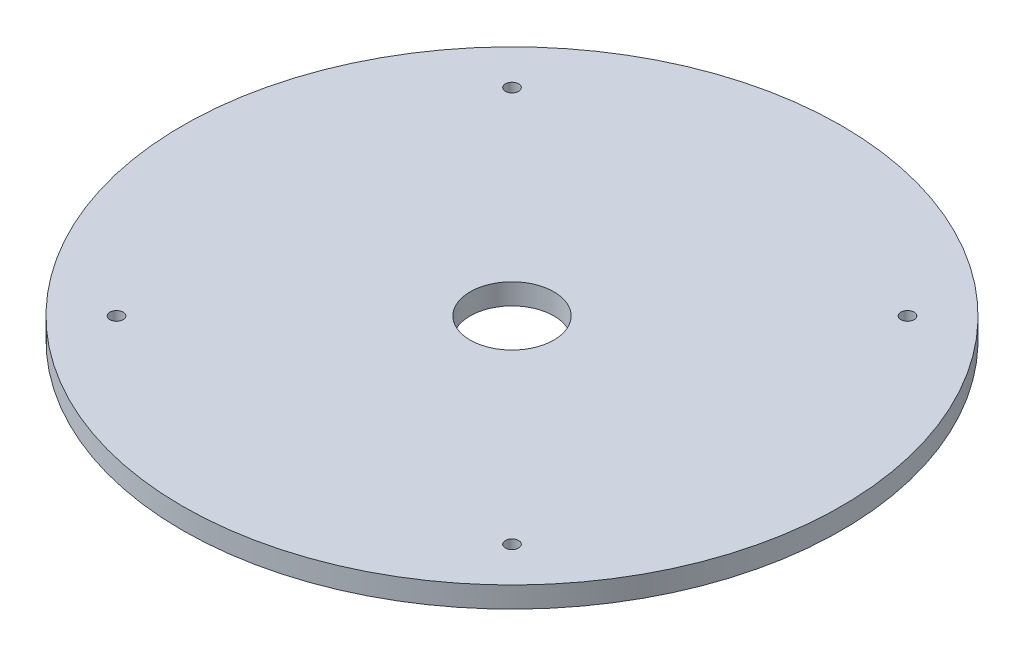
ISO-10303-21;
HEADER;
FILE_DESCRIPTION(('STEP AP214'),'2;1');
FILE_NAME('part.step','',(''),(''),'','','');
FILE_SCHEMA(('AUTOMOTIVE_DESIGN { 1 0 10303 214 1 1 1 1 }'));
ENDSEC;
DATA;
#1=APPLICATION_CONTEXT('core data for automotive mechanical design processes');
#2=APPLICATION_PROTOCOL_DEFINITION('international standard','automotive_design',2000,#1);
#3=PRODUCT_CONTEXT('',#1,'mechanical');
#4=PRODUCT('Part','Part','',(#3));
#5=PRODUCT_RELATED_PRODUCT_CATEGORY('part','',(#4));
#6=PRODUCT_DEFINITION_FORMATION('','',#4);
#7=PRODUCT_DEFINITION_CONTEXT('part definition',#1,'design');
#8=PRODUCT_DEFINITION('design','',#6,#7);
#9=PRODUCT_DEFINITION_SHAPE('','',#8);
#10=(LENGTH_UNIT() NAMED_UNIT(*) SI_UNIT(.MILLI.,.METRE.));
#11=(NAMED_UNIT(*) PLANE_ANGLE_UNIT() SI_UNIT($,.RADIAN.));
#12=(NAMED_UNIT(*) SI_UNIT($,.STERADIAN.) SOLID_ANGLE_UNIT());
#13=UNCERTAINTY_MEASURE_WITH_UNIT(LENGTH_MEASURE(1.E-05),#10,'distance_accuracy_value','');
#14=(GEOMETRIC_REPRESENTATION_CONTEXT(3) GLOBAL_UNCERTAINTY_ASSIGNED_CONTEXT((#13)) GLOBAL_UNIT_ASSIGNED_CONTEXT((#10,
#11,#12)) REPRESENTATION_CONTEXT('',''));
#15=CARTESIAN_POINT('',(0.,0.,0.));
#16=DIRECTION('',(0.,0.,1.));
#17=DIRECTION('',(1.,0.,0.));
#18=AXIS2_PLACEMENT_3D('',#15,#16,#17);
#19=CARTESIAN_POINT('',(0.,3.175,0.));
#20=DIRECTION('',(0.,1.,0.));
#21=DIRECTION('',(0.,0.,1.));
#22=AXIS2_PLACEMENT_3D('',#19,#20,#21);
#23=PLANE('',#22);
#24=CARTESIAN_POINT('',(-30.,3.175,30.));
#25=DIRECTION('',(0.,1.,0.));
#26=DIRECTION('',(0.,0.,1.));
#27=AXIS2_PLACEMENT_3D('',#24,#25,#26);
#28=CIRCLE('',#27,1.);
#29=CARTESIAN_POINT('',(-30.,3.175,31.));
#30=VERTEX_POINT('',#29);
#31=EDGE_CURVE('E65',#30,#30,#28,.T.);
#32=ORIENTED_EDGE('',*,*,#31,.F.);
#33=EDGE_LOOP('',(#32));
#34=FACE_BOUND('',#33,.T.);
#35=CARTESIAN_POINT('',(30.,3.175,-30.));
#36=DIRECTION('',(0.,1.,0.));
#37=DIRECTION('',(0.,0.,1.));
#38=AXIS2_PLACEMENT_3D('',#35,#36,#37);
#39=CIRCLE('',#38,1.);
#40=CARTESIAN_POINT('',(30.,3.175,-29.));
#41=VERTEX_POINT('',#40);
#42=EDGE_CURVE('E53',#41,#41,#39,.T.);
#43=ORIENTED_EDGE('',*,*,#42,.F.);
#44=EDGE_LOOP('',(#43));
#45=FACE_BOUND('',#44,.T.);
#46=CARTESIAN_POINT('',(0.,3.175,0.));
#47=DIRECTION('',(0.,1.,0.));
#48=DIRECTION('',(0.,0.,1.));
#49=AXIS2_PLACEMENT_3D('',#46,#47,#48);
#50=CIRCLE('',#49,50.);
#51=CARTESIAN_POINT('',(0.,3.175,50.));
#52=VERTEX_POINT('',#51);
#53=EDGE_CURVE('E10',#52,#52,#50,.T.);
#54=ORIENTED_EDGE('',*,*,#53,.T.);
#55=EDGE_LOOP('',(#54));
#56=FACE_BOUND('',#55,.T.);
#57=CARTESIAN_POINT('',(-30.,3.175,-30.));
#58=DIRECTION('',(0.,1.,0.));
#59=DIRECTION('',(0.,0.,1.));
#60=AXIS2_PLACEMENT_3D('',#57,#58,#59);
#61=CIRCLE('',#60,1.);
#62=CARTESIAN_POINT('',(-30.,3.175,-29.));
#63=VERTEX_POINT('',#62);
#64=EDGE_CURVE('E48',#63,#63,#61,.T.);
#65=ORIENTED_EDGE('',*,*,#64,.F.);
#66=EDGE_LOOP('',(#65));
#67=FACE_BOUND('',#66,.T.);
#68=CARTESIAN_POINT('',(30.,3.175,30.));
#69=DIRECTION('',(0.,1.,0.));
#70=DIRECTION('',(0.,0.,1.));
#71=AXIS2_PLACEMENT_3D('',#68,#69,#70);
#72=CIRCLE('',#71,1.);
#73=CARTESIAN_POINT('',(30.,3.175,31.));
#74=VERTEX_POINT('',#73);
#75=EDGE_CURVE('E59',#74,#74,#72,.T.);
#76=ORIENTED_EDGE('',*,*,#75,.F.);
#77=EDGE_LOOP('',(#76));
#78=FACE_BOUND('',#77,.T.);
#79=CARTESIAN_POINT('',(0.,3.175,0.));
#80=DIRECTION('',(0.,1.,0.));
#81=DIRECTION('',(0.,0.,1.));
#82=AXIS2_PLACEMENT_3D('',#79,#80,#81);
#83=CIRCLE('',#82,6.35);
#84=CARTESIAN_POINT('',(0.,3.175,6.35));
#85=VERTEX_POINT('',#84);
#86=EDGE_CURVE('E71',#85,#85,#83,.T.);
#87=ORIENTED_EDGE('',*,*,#86,.F.);
#88=EDGE_LOOP('',(#87));
#89=FACE_BOUND('',#88,.T.);
#90=ADVANCED_FACE('F37',(#34,#45,#56,#67,#78,#89),#23,.T.);
#91=CARTESIAN_POINT('',(0.,0.,0.));
#92=DIRECTION('',(0.,1.,0.));
#93=DIRECTION('',(0.,0.,1.));
#94=AXIS2_PLACEMENT_3D('',#91,#92,#93);
#95=PLANE('',#94);
#96=CARTESIAN_POINT('',(0.,0.,0.));
#97=DIRECTION('',(0.,1.,0.));
#98=DIRECTION('',(0.,0.,1.));
#99=AXIS2_PLACEMENT_3D('',#96,#97,#98);
#100=CIRCLE('',#99,50.);
#101=CARTESIAN_POINT('',(0.,0.,50.));
#102=VERTEX_POINT('',#101);
#103=EDGE_CURVE('E41',#102,#102,#100,.T.);
#104=ORIENTED_EDGE('',*,*,#103,.F.);
#105=EDGE_LOOP('',(#104));
#106=FACE_BOUND('',#105,.T.);
#107=CARTESIAN_POINT('',(-30.,0.,-30.));
#108=DIRECTION('',(0.,1.,0.));
#109=DIRECTION('',(0.,0.,1.));
#110=AXIS2_PLACEMENT_3D('',#107,#108,#109);
#111=CIRCLE('',#110,1.);
#112=CARTESIAN_POINT('',(-30.,0.,-29.));
#113=VERTEX_POINT('',#112);
#114=EDGE_CURVE('E50',#113,#113,#111,.T.);
#115=ORIENTED_EDGE('',*,*,#114,.T.);
#116=EDGE_LOOP('',(#115));
#117=FACE_BOUND('',#116,.T.);
#118=CARTESIAN_POINT('',(30.,0.,-30.));
#119=DIRECTION('',(0.,1.,0.));
#120=DIRECTION('',(0.,0.,1.));
#121=AXIS2_PLACEMENT_3D('',#118,#119,#120);
#122=CIRCLE('',#121,1.);
#123=CARTESIAN_POINT('',(30.,0.,-29.));
#124=VERTEX_POINT('',#123);
#125=EDGE_CURVE('E56',#124,#124,#122,.T.);
#126=ORIENTED_EDGE('',*,*,#125,.T.);
#127=EDGE_LOOP('',(#126));
#128=FACE_BOUND('',#127,.T.);
#129=CARTESIAN_POINT('',(30.,0.,30.));
#130=DIRECTION('',(0.,1.,0.));
#131=DIRECTION('',(0.,0.,1.));
#132=AXIS2_PLACEMENT_3D('',#129,#130,#131);
#133=CIRCLE('',#132,1.);
#134=CARTESIAN_POINT('',(30.,0.,31.));
#135=VERTEX_POINT('',#134);
#136=EDGE_CURVE('E62',#135,#135,#133,.T.);
#137=ORIENTED_EDGE('',*,*,#136,.T.);
#138=EDGE_LOOP('',(#137));
#139=FACE_BOUND('',#138,.T.);
#140=CARTESIAN_POINT('',(-30.,0.,30.));
#141=DIRECTION('',(0.,1.,0.));
#142=DIRECTION('',(0.,0.,1.));
#143=AXIS2_PLACEMENT_3D('',#140,#141,#142);
#144=CIRCLE('',#143,1.);
#145=CARTESIAN_POINT('',(-30.,0.,31.));
#146=VERTEX_POINT('',#145);
#147=EDGE_CURVE('E68',#146,#146,#144,.T.);
#148=ORIENTED_EDGE('',*,*,#147,.T.);
#149=EDGE_LOOP('',(#148));
#150=FACE_BOUND('',#149,.T.);
#151=CARTESIAN_POINT('',(0.,0.,0.));
#152=DIRECTION('',(0.,1.,0.));
#153=DIRECTION('',(0.,0.,1.));
#154=AXIS2_PLACEMENT_3D('',#151,#152,#153);
#155=CIRCLE('',#154,6.35);
#156=CARTESIAN_POINT('',(0.,0.,6.35));
#157=VERTEX_POINT('',#156);
#158=EDGE_CURVE('E74',#157,#157,#155,.T.);
#159=ORIENTED_EDGE('',*,*,#158,.T.);
#160=EDGE_LOOP('',(#159));
#161=FACE_BOUND('',#160,.T.);
#162=ADVANCED_FACE('F84',(#106,#117,#128,#139,#150,#161),#95,.F.);
#163=CARTESIAN_POINT('',(0.,3.175,0.));
#164=DIRECTION('',(0.,-1.,0.));
#165=DIRECTION('',(0.,0.,-1.));
#166=AXIS2_PLACEMENT_3D('',#163,#164,#165);
#167=CYLINDRICAL_SURFACE('',#166,50.);
#168=ORIENTED_EDGE('',*,*,#53,.F.);
#169=EDGE_LOOP('',(#168));
#170=FACE_BOUND('',#169,.T.);
#171=ORIENTED_EDGE('',*,*,#103,.T.);
#172=EDGE_LOOP('',(#171));
#173=FACE_BOUND('',#172,.T.);
#174=ADVANCED_FACE('F39',(#170,#173),#167,.T.);
#175=CARTESIAN_POINT('',(-30.,3.175,-30.));
#176=DIRECTION('',(0.,-1.,0.));
#177=DIRECTION('',(0.,0.,-1.));
#178=AXIS2_PLACEMENT_3D('',#175,#176,#177);
#179=CYLINDRICAL_SURFACE('',#178,1.);
#180=ORIENTED_EDGE('',*,*,#64,.T.);
#181=EDGE_LOOP('',(#180));
#182=FACE_BOUND('',#181,.T.);
#183=ORIENTED_EDGE('',*,*,#114,.F.);
#184=EDGE_LOOP('',(#183));
#185=FACE_BOUND('',#184,.T.);
#186=ADVANCED_FACE('F94',(#182,#185),#179,.F.);
#187=CARTESIAN_POINT('',(30.,3.175,-30.));
#188=DIRECTION('',(0.,-1.,0.));
#189=DIRECTION('',(0.,0.,-1.));
#190=AXIS2_PLACEMENT_3D('',#187,#188,#189);
#191=CYLINDRICAL_SURFACE('',#190,1.);
#192=ORIENTED_EDGE('',*,*,#42,.T.);
#193=EDGE_LOOP('',(#192));
#194=FACE_BOUND('',#193,.T.);
#195=ORIENTED_EDGE('',*,*,#125,.F.);
#196=EDGE_LOOP('',(#195));
#197=FACE_BOUND('',#196,.T.);
#198=ADVANCED_FACE('F97',(#194,#197),#191,.F.);
#199=CARTESIAN_POINT('',(30.,3.175,30.));
#200=DIRECTION('',(0.,-1.,0.));
#201=DIRECTION('',(0.,0.,-1.));
#202=AXIS2_PLACEMENT_3D('',#199,#200,#201);
#203=CYLINDRICAL_SURFACE('',#202,1.);
#204=ORIENTED_EDGE('',*,*,#75,.T.);
#205=EDGE_LOOP('',(#204));
#206=FACE_BOUND('',#205,.T.);
#207=ORIENTED_EDGE('',*,*,#136,.F.);
#208=EDGE_LOOP('',(#207));
#209=FACE_BOUND('',#208,.T.);
#210=ADVANCED_FACE('F101',(#206,#209),#203,.F.);
#211=CARTESIAN_POINT('',(-30.,3.175,30.));
#212=DIRECTION('',(0.,-1.,0.));
#213=DIRECTION('',(0.,0.,-1.));
#214=AXIS2_PLACEMENT_3D('',#211,#212,#213);
#215=CYLINDRICAL_SURFACE('',#214,1.);
#216=ORIENTED_EDGE('',*,*,#31,.T.);
#217=EDGE_LOOP('',(#216));
#218=FACE_BOUND('',#217,.T.);
#219=ORIENTED_EDGE('',*,*,#147,.F.);
#220=EDGE_LOOP('',(#219));
#221=FACE_BOUND('',#220,.T.);
#222=ADVANCED_FACE('F105',(#218,#221),#215,.F.);
#223=CARTESIAN_POINT('',(0.,3.175,0.));
#224=DIRECTION('',(0.,-1.,0.));
#225=DIRECTION('',(0.,0.,-1.));
#226=AXIS2_PLACEMENT_3D('',#223,#224,#225);
#227=CYLINDRICAL_SURFACE('',#226,6.35);
#228=ORIENTED_EDGE('',*,*,#86,.T.);
#229=EDGE_LOOP('',(#228));
#230=FACE_BOUND('',#229,.T.);
#231=ORIENTED_EDGE('',*,*,#158,.F.);
#232=EDGE_LOOP('',(#231));
#233=FACE_BOUND('',#232,.T.);
#234=ADVANCED_FACE('F80',(#230,#233),#227,.F.);
#235=CLOSED_SHELL('',(#90,#162,#174,#186,#198,#210,#222,#234));
#236=MANIFOLD_SOLID_BREP('B2',#235);
#237=ADVANCED_BREP_SHAPE_REPRESENTATION('',(#18,#236),#14);
#238=SHAPE_DEFINITION_REPRESENTATION(#9,#237);
ENDSEC;
END-ISO-10303-21;
